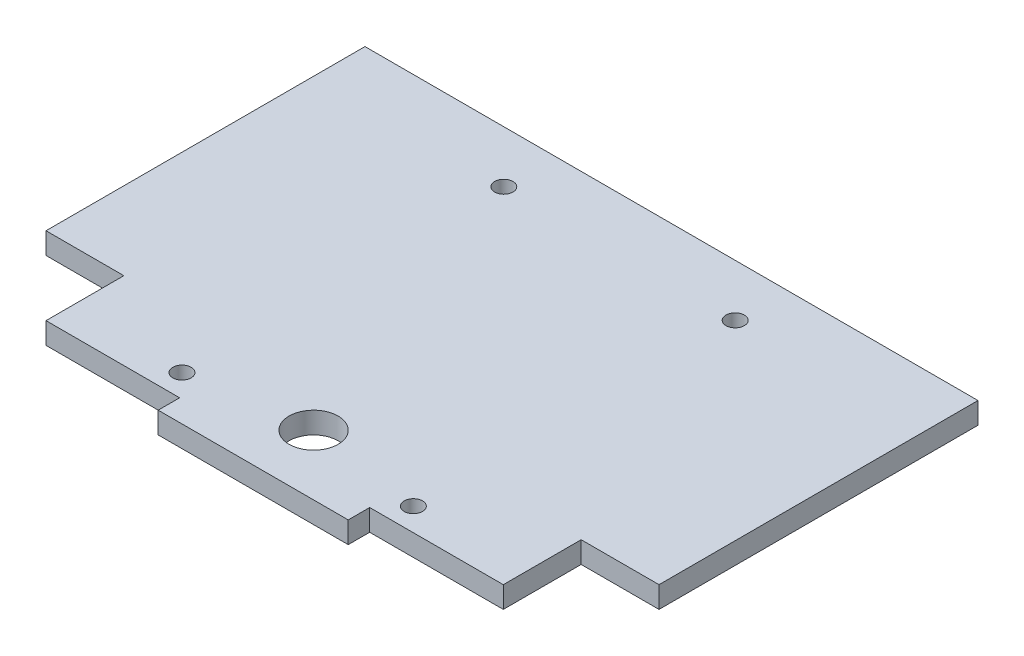
ISO-10303-21;
HEADER;
FILE_DESCRIPTION(('STEP AP214'),'2;1');
FILE_NAME('part.step','',(''),(''),'','','');
FILE_SCHEMA(('AUTOMOTIVE_DESIGN { 1 0 10303 214 1 1 1 1 }'));
ENDSEC;
DATA;
#1=APPLICATION_CONTEXT('core data for automotive mechanical design processes');
#2=APPLICATION_PROTOCOL_DEFINITION('international standard','automotive_design',2000,#1);
#3=PRODUCT_CONTEXT('',#1,'mechanical');
#4=PRODUCT('Part','Part','',(#3));
#5=PRODUCT_RELATED_PRODUCT_CATEGORY('part','',(#4));
#6=PRODUCT_DEFINITION_FORMATION('','',#4);
#7=PRODUCT_DEFINITION_CONTEXT('part definition',#1,'design');
#8=PRODUCT_DEFINITION('design','',#6,#7);
#9=PRODUCT_DEFINITION_SHAPE('','',#8);
#10=(LENGTH_UNIT() NAMED_UNIT(*) SI_UNIT(.MILLI.,.METRE.));
#11=(NAMED_UNIT(*) PLANE_ANGLE_UNIT() SI_UNIT($,.RADIAN.));
#12=(NAMED_UNIT(*) SI_UNIT($,.STERADIAN.) SOLID_ANGLE_UNIT());
#13=UNCERTAINTY_MEASURE_WITH_UNIT(LENGTH_MEASURE(1.E-05),#10,'distance_accuracy_value','');
#14=(GEOMETRIC_REPRESENTATION_CONTEXT(3) GLOBAL_UNCERTAINTY_ASSIGNED_CONTEXT((#13)) GLOBAL_UNIT_ASSIGNED_CONTEXT((#10,
#11,#12)) REPRESENTATION_CONTEXT('',''));
#15=CARTESIAN_POINT('',(0.,0.,0.));
#16=DIRECTION('',(0.,0.,1.));
#17=DIRECTION('',(1.,0.,0.));
#18=AXIS2_PLACEMENT_3D('',#15,#16,#17);
#19=CARTESIAN_POINT('',(0.,7.,-25.4));
#20=DIRECTION('',(0.,0.,-1.));
#21=DIRECTION('',(-1.,0.,0.));
#22=AXIS2_PLACEMENT_3D('',#19,#20,#21);
#23=PLANE('',#22);
#24=DIRECTION('',(1.,0.,0.));
#25=VECTOR('',#24,1.);
#26=CARTESIAN_POINT('',(0.,0.,-25.4));
#27=LINE('',#26,#25);
#28=CARTESIAN_POINT('',(-100.,0.,-25.4));
#29=VERTEX_POINT('',#28);
#30=CARTESIAN_POINT('',(-74.6,0.,-25.4));
#31=VERTEX_POINT('',#30);
#32=EDGE_CURVE('E141',#29,#31,#27,.T.);
#33=ORIENTED_EDGE('',*,*,#32,.T.);
#34=DIRECTION('',(0.,-1.,0.));
#35=VECTOR('',#34,1.);
#36=CARTESIAN_POINT('',(-74.6,7.,-25.4));
#37=LINE('',#36,#35);
#38=CARTESIAN_POINT('',(-74.6,7.,-25.4));
#39=VERTEX_POINT('',#38);
#40=EDGE_CURVE('E136',#39,#31,#37,.T.);
#41=ORIENTED_EDGE('',*,*,#40,.F.);
#42=DIRECTION('',(1.,0.,0.));
#43=VECTOR('',#42,1.);
#44=CARTESIAN_POINT('',(0.,7.,-25.4));
#45=LINE('',#44,#43);
#46=CARTESIAN_POINT('',(-100.,7.,-25.4));
#47=VERTEX_POINT('',#46);
#48=EDGE_CURVE('E220',#47,#39,#45,.T.);
#49=ORIENTED_EDGE('',*,*,#48,.F.);
#50=DIRECTION('',(0.,-1.,0.));
#51=VECTOR('',#50,1.);
#52=CARTESIAN_POINT('',(-100.,7.,-25.4));
#53=LINE('',#52,#51);
#54=EDGE_CURVE('E54',#47,#29,#53,.T.);
#55=ORIENTED_EDGE('',*,*,#54,.T.);
#56=EDGE_LOOP('',(#33,#41,#49,#55));
#57=FACE_BOUND('',#56,.T.);
#58=ADVANCED_FACE('F44',(#57),#23,.F.);
#59=CARTESIAN_POINT('',(-100.,7.,0.));
#60=DIRECTION('',(-1.,0.,0.));
#61=DIRECTION('',(0.,0.,1.));
#62=AXIS2_PLACEMENT_3D('',#59,#60,#61);
#63=PLANE('',#62);
#64=DIRECTION('',(0.,0.,-1.));
#65=VECTOR('',#64,1.);
#66=CARTESIAN_POINT('',(-100.,0.,0.));
#67=LINE('',#66,#65);
#68=CARTESIAN_POINT('',(-100.,0.,-129.468576745222));
#69=VERTEX_POINT('',#68);
#70=EDGE_CURVE('E87',#29,#69,#67,.T.);
#71=ORIENTED_EDGE('',*,*,#70,.F.);
#72=ORIENTED_EDGE('',*,*,#54,.F.);
#73=DIRECTION('',(0.,0.,-1.));
#74=VECTOR('',#73,1.);
#75=CARTESIAN_POINT('',(-100.,7.,0.));
#76=LINE('',#75,#74);
#77=CARTESIAN_POINT('',(-100.,7.,-129.468576745222));
#78=VERTEX_POINT('',#77);
#79=EDGE_CURVE('E79',#47,#78,#76,.T.);
#80=ORIENTED_EDGE('',*,*,#79,.T.);
#81=DIRECTION('',(0.,-1.,0.));
#82=VECTOR('',#81,1.);
#83=CARTESIAN_POINT('',(-100.,7.,-129.468576745222));
#84=LINE('',#83,#82);
#85=EDGE_CURVE('E48',#78,#69,#84,.T.);
#86=ORIENTED_EDGE('',*,*,#85,.T.);
#87=EDGE_LOOP('',(#71,#72,#80,#86));
#88=FACE_BOUND('',#87,.T.);
#89=ADVANCED_FACE('F356',(#88),#63,.T.);
#90=CARTESIAN_POINT('',(0.,7.,-12.7));
#91=DIRECTION('',(0.,-1.,0.));
#92=DIRECTION('',(0.,0.,-1.));
#93=AXIS2_PLACEMENT_3D('',#90,#91,#92);
#94=CYLINDRICAL_SURFACE('',#93,8.);
#95=CARTESIAN_POINT('',(0.,0.,-12.7));
#96=DIRECTION('',(0.,1.,0.));
#97=DIRECTION('',(0.,0.,1.));
#98=AXIS2_PLACEMENT_3D('',#95,#96,#97);
#99=CIRCLE('',#98,8.);
#100=CARTESIAN_POINT('',(0.,0.,-4.69999999999999));
#101=VERTEX_POINT('',#100);
#102=EDGE_CURVE('E230',#101,#101,#99,.F.);
#103=ORIENTED_EDGE('',*,*,#102,.T.);
#104=EDGE_LOOP('',(#103));
#105=FACE_BOUND('',#104,.T.);
#106=CARTESIAN_POINT('',(0.,7.,-12.7));
#107=DIRECTION('',(0.,1.,0.));
#108=DIRECTION('',(0.,0.,1.));
#109=AXIS2_PLACEMENT_3D('',#106,#107,#108);
#110=CIRCLE('',#109,8.);
#111=CARTESIAN_POINT('',(0.,7.,-4.69999999999999));
#112=VERTEX_POINT('',#111);
#113=EDGE_CURVE('E126',#112,#112,#110,.F.);
#114=ORIENTED_EDGE('',*,*,#113,.F.);
#115=EDGE_LOOP('',(#114));
#116=FACE_BOUND('',#115,.T.);
#117=ADVANCED_FACE('F354',(#105,#116),#94,.F.);
#118=CARTESIAN_POINT('',(0.,0.,0.));
#119=DIRECTION('',(0.,1.,0.));
#120=DIRECTION('',(0.,0.,1.));
#121=AXIS2_PLACEMENT_3D('',#118,#119,#120);
#122=PLANE('',#121);
#123=CARTESIAN_POINT('',(-37.75,0.,-7.5));
#124=DIRECTION('',(0.,1.,0.));
#125=DIRECTION('',(0.,0.,1.));
#126=AXIS2_PLACEMENT_3D('',#123,#124,#125);
#127=CIRCLE('',#126,3.);
#128=CARTESIAN_POINT('',(-37.75,0.,-4.5));
#129=VERTEX_POINT('',#128);
#130=EDGE_CURVE('E280',#129,#129,#127,.T.);
#131=ORIENTED_EDGE('',*,*,#130,.T.);
#132=EDGE_LOOP('',(#131));
#133=FACE_BOUND('',#132,.T.);
#134=CARTESIAN_POINT('',(37.75,0.,-7.50000000000001));
#135=DIRECTION('',(0.,1.,0.));
#136=DIRECTION('',(0.,0.,1.));
#137=AXIS2_PLACEMENT_3D('',#134,#135,#136);
#138=CIRCLE('',#137,3.);
#139=CARTESIAN_POINT('',(37.75,0.,-4.50000000000002));
#140=VERTEX_POINT('',#139);
#141=EDGE_CURVE('E271',#140,#140,#138,.T.);
#142=ORIENTED_EDGE('',*,*,#141,.T.);
#143=EDGE_LOOP('',(#142));
#144=FACE_BOUND('',#143,.T.);
#145=CARTESIAN_POINT('',(37.75,0.,-112.5));
#146=DIRECTION('',(0.,1.,0.));
#147=DIRECTION('',(0.,0.,1.));
#148=AXIS2_PLACEMENT_3D('',#145,#146,#147);
#149=CIRCLE('',#148,3.);
#150=CARTESIAN_POINT('',(37.75,0.,-109.5));
#151=VERTEX_POINT('',#150);
#152=EDGE_CURVE('E262',#151,#151,#149,.T.);
#153=ORIENTED_EDGE('',*,*,#152,.T.);
#154=EDGE_LOOP('',(#153));
#155=FACE_BOUND('',#154,.T.);
#156=CARTESIAN_POINT('',(-37.75,0.,-112.5));
#157=DIRECTION('',(0.,1.,0.));
#158=DIRECTION('',(0.,0.,1.));
#159=AXIS2_PLACEMENT_3D('',#156,#157,#158);
#160=CIRCLE('',#159,3.);
#161=CARTESIAN_POINT('',(-37.75,0.,-109.5));
#162=VERTEX_POINT('',#161);
#163=EDGE_CURVE('E256',#162,#162,#160,.T.);
#164=ORIENTED_EDGE('',*,*,#163,.T.);
#165=EDGE_LOOP('',(#164));
#166=FACE_BOUND('',#165,.T.);
#167=ORIENTED_EDGE('',*,*,#102,.F.);
#168=EDGE_LOOP('',(#167));
#169=FACE_BOUND('',#168,.T.);
#170=DIRECTION('',(0.,0.,1.));
#171=VECTOR('',#170,1.);
#172=CARTESIAN_POINT('',(31.,0.,0.));
#173=LINE('',#172,#171);
#174=CARTESIAN_POINT('',(31.,0.,0.));
#175=VERTEX_POINT('',#174);
#176=CARTESIAN_POINT('',(31.,0.,7.));
#177=VERTEX_POINT('',#176);
#178=EDGE_CURVE('E95',#175,#177,#173,.T.);
#179=ORIENTED_EDGE('',*,*,#178,.T.);
#180=DIRECTION('',(-1.,0.,0.));
#181=VECTOR('',#180,1.);
#182=CARTESIAN_POINT('',(0.,0.,7.));
#183=LINE('',#182,#181);
#184=CARTESIAN_POINT('',(-31.,0.,7.));
#185=VERTEX_POINT('',#184);
#186=EDGE_CURVE('E311',#177,#185,#183,.T.);
#187=ORIENTED_EDGE('',*,*,#186,.T.);
#188=DIRECTION('',(0.,0.,1.));
#189=VECTOR('',#188,1.);
#190=CARTESIAN_POINT('',(-31.,0.,0.));
#191=LINE('',#190,#189);
#192=CARTESIAN_POINT('',(-31.,0.,0.));
#193=VERTEX_POINT('',#192);
#194=EDGE_CURVE('E125',#193,#185,#191,.T.);
#195=ORIENTED_EDGE('',*,*,#194,.F.);
#196=DIRECTION('',(-1.,0.,0.));
#197=VECTOR('',#196,1.);
#198=CARTESIAN_POINT('',(0.,0.,0.));
#199=LINE('',#198,#197);
#200=CARTESIAN_POINT('',(-74.6,0.,0.));
#201=VERTEX_POINT('',#200);
#202=EDGE_CURVE('E118',#193,#201,#199,.T.);
#203=ORIENTED_EDGE('',*,*,#202,.T.);
#204=DIRECTION('',(0.,0.,-1.));
#205=VECTOR('',#204,1.);
#206=CARTESIAN_POINT('',(-74.6,0.,0.));
#207=LINE('',#206,#205);
#208=EDGE_CURVE('E122',#201,#31,#207,.T.);
#209=ORIENTED_EDGE('',*,*,#208,.T.);
#210=ORIENTED_EDGE('',*,*,#32,.F.);
#211=ORIENTED_EDGE('',*,*,#70,.T.);
#212=DIRECTION('',(1.,0.,0.));
#213=VECTOR('',#212,1.);
#214=CARTESIAN_POINT('',(-100.,0.,-129.468576745222));
#215=LINE('',#214,#213);
#216=CARTESIAN_POINT('',(100.,0.,-129.468576745222));
#217=VERTEX_POINT('',#216);
#218=EDGE_CURVE('E215',#69,#217,#215,.T.);
#219=ORIENTED_EDGE('',*,*,#218,.T.);
#220=DIRECTION('',(0.,0.,-1.));
#221=VECTOR('',#220,1.);
#222=CARTESIAN_POINT('',(100.,0.,0.));
#223=LINE('',#222,#221);
#224=CARTESIAN_POINT('',(100.,0.,-25.4));
#225=VERTEX_POINT('',#224);
#226=EDGE_CURVE('E180',#225,#217,#223,.T.);
#227=ORIENTED_EDGE('',*,*,#226,.F.);
#228=DIRECTION('',(-1.,0.,0.));
#229=VECTOR('',#228,1.);
#230=CARTESIAN_POINT('',(0.,0.,-25.4));
#231=LINE('',#230,#229);
#232=CARTESIAN_POINT('',(74.6,0.,-25.4));
#233=VERTEX_POINT('',#232);
#234=EDGE_CURVE('E202',#225,#233,#231,.T.);
#235=ORIENTED_EDGE('',*,*,#234,.T.);
#236=DIRECTION('',(0.,0.,-1.));
#237=VECTOR('',#236,1.);
#238=CARTESIAN_POINT('',(74.6,0.,0.));
#239=LINE('',#238,#237);
#240=CARTESIAN_POINT('',(74.6,0.,0.));
#241=VERTEX_POINT('',#240);
#242=EDGE_CURVE('E199',#241,#233,#239,.T.);
#243=ORIENTED_EDGE('',*,*,#242,.F.);
#244=DIRECTION('',(1.,0.,0.));
#245=VECTOR('',#244,1.);
#246=CARTESIAN_POINT('',(0.,0.,0.));
#247=LINE('',#246,#245);
#248=EDGE_CURVE('E174',#175,#241,#247,.T.);
#249=ORIENTED_EDGE('',*,*,#248,.F.);
#250=EDGE_LOOP('',(#179,#187,#195,#203,#209,#210,#211,#219,#227,#235,#243,#249));
#251=FACE_BOUND('',#250,.T.);
#252=ADVANCED_FACE('F120',(#133,#144,#155,#166,#169,#251),#122,.F.);
#253=CARTESIAN_POINT('',(-74.6,7.,0.));
#254=DIRECTION('',(-1.,0.,0.));
#255=DIRECTION('',(0.,0.,1.));
#256=AXIS2_PLACEMENT_3D('',#253,#254,#255);
#257=PLANE('',#256);
#258=ORIENTED_EDGE('',*,*,#208,.F.);
#259=DIRECTION('',(0.,-1.,0.));
#260=VECTOR('',#259,1.);
#261=CARTESIAN_POINT('',(-74.6,7.,0.));
#262=LINE('',#261,#260);
#263=CARTESIAN_POINT('',(-74.6,7.,0.));
#264=VERTEX_POINT('',#263);
#265=EDGE_CURVE('E129',#264,#201,#262,.T.);
#266=ORIENTED_EDGE('',*,*,#265,.F.);
#267=DIRECTION('',(0.,0.,-1.));
#268=VECTOR('',#267,1.);
#269=CARTESIAN_POINT('',(-74.6,7.,0.));
#270=LINE('',#269,#268);
#271=EDGE_CURVE('E226',#264,#39,#270,.T.);
#272=ORIENTED_EDGE('',*,*,#271,.T.);
#273=ORIENTED_EDGE('',*,*,#40,.T.);
#274=EDGE_LOOP('',(#258,#266,#272,#273));
#275=FACE_BOUND('',#274,.T.);
#276=ADVANCED_FACE('F138',(#275),#257,.T.);
#277=CARTESIAN_POINT('',(0.,7.,0.));
#278=DIRECTION('',(0.,1.,0.));
#279=DIRECTION('',(0.,0.,1.));
#280=AXIS2_PLACEMENT_3D('',#277,#278,#279);
#281=PLANE('',#280);
#282=CARTESIAN_POINT('',(-37.75,7.,-7.5));
#283=DIRECTION('',(0.,1.,0.));
#284=DIRECTION('',(0.,0.,1.));
#285=AXIS2_PLACEMENT_3D('',#282,#283,#284);
#286=CIRCLE('',#285,2.99999999999999);
#287=CARTESIAN_POINT('',(-37.75,7.,-4.50000000000001));
#288=VERTEX_POINT('',#287);
#289=EDGE_CURVE('E282',#288,#288,#286,.T.);
#290=ORIENTED_EDGE('',*,*,#289,.F.);
#291=EDGE_LOOP('',(#290));
#292=FACE_BOUND('',#291,.T.);
#293=CARTESIAN_POINT('',(37.75,7.,-7.50000000000001));
#294=DIRECTION('',(0.,1.,0.));
#295=DIRECTION('',(0.,0.,1.));
#296=AXIS2_PLACEMENT_3D('',#293,#294,#295);
#297=CIRCLE('',#296,2.99999999999999);
#298=CARTESIAN_POINT('',(37.75,7.,-4.50000000000002));
#299=VERTEX_POINT('',#298);
#300=EDGE_CURVE('E276',#299,#299,#297,.T.);
#301=ORIENTED_EDGE('',*,*,#300,.F.);
#302=EDGE_LOOP('',(#301));
#303=FACE_BOUND('',#302,.T.);
#304=CARTESIAN_POINT('',(37.75,7.,-112.5));
#305=DIRECTION('',(0.,1.,0.));
#306=DIRECTION('',(0.,0.,1.));
#307=AXIS2_PLACEMENT_3D('',#304,#305,#306);
#308=CIRCLE('',#307,2.99999999999999);
#309=CARTESIAN_POINT('',(37.75,7.,-109.5));
#310=VERTEX_POINT('',#309);
#311=EDGE_CURVE('E267',#310,#310,#308,.T.);
#312=ORIENTED_EDGE('',*,*,#311,.F.);
#313=EDGE_LOOP('',(#312));
#314=FACE_BOUND('',#313,.T.);
#315=CARTESIAN_POINT('',(-37.75,7.,-112.5));
#316=DIRECTION('',(0.,1.,0.));
#317=DIRECTION('',(0.,0.,1.));
#318=AXIS2_PLACEMENT_3D('',#315,#316,#317);
#319=CIRCLE('',#318,2.99999999999999);
#320=CARTESIAN_POINT('',(-37.75,7.,-109.5));
#321=VERTEX_POINT('',#320);
#322=EDGE_CURVE('E258',#321,#321,#319,.T.);
#323=ORIENTED_EDGE('',*,*,#322,.F.);
#324=EDGE_LOOP('',(#323));
#325=FACE_BOUND('',#324,.T.);
#326=ORIENTED_EDGE('',*,*,#113,.T.);
#327=EDGE_LOOP('',(#326));
#328=FACE_BOUND('',#327,.T.);
#329=DIRECTION('',(-1.,0.,0.));
#330=VECTOR('',#329,1.);
#331=CARTESIAN_POINT('',(0.,7.,7.));
#332=LINE('',#331,#330);
#333=CARTESIAN_POINT('',(31.,7.,7.));
#334=VERTEX_POINT('',#333);
#335=CARTESIAN_POINT('',(-31.,7.,7.));
#336=VERTEX_POINT('',#335);
#337=EDGE_CURVE('E148',#334,#336,#332,.T.);
#338=ORIENTED_EDGE('',*,*,#337,.F.);
#339=DIRECTION('',(0.,0.,1.));
#340=VECTOR('',#339,1.);
#341=CARTESIAN_POINT('',(31.,7.,0.));
#342=LINE('',#341,#340);
#343=CARTESIAN_POINT('',(31.,7.,0.));
#344=VERTEX_POINT('',#343);
#345=EDGE_CURVE('E163',#344,#334,#342,.T.);
#346=ORIENTED_EDGE('',*,*,#345,.F.);
#347=DIRECTION('',(1.,0.,0.));
#348=VECTOR('',#347,1.);
#349=CARTESIAN_POINT('',(0.,7.,0.));
#350=LINE('',#349,#348);
#351=CARTESIAN_POINT('',(74.6,7.,0.));
#352=VERTEX_POINT('',#351);
#353=EDGE_CURVE('E175',#344,#352,#350,.T.);
#354=ORIENTED_EDGE('',*,*,#353,.T.);
#355=DIRECTION('',(0.,0.,-1.));
#356=VECTOR('',#355,1.);
#357=CARTESIAN_POINT('',(74.6,7.,0.));
#358=LINE('',#357,#356);
#359=CARTESIAN_POINT('',(74.6,7.,-25.4));
#360=VERTEX_POINT('',#359);
#361=EDGE_CURVE('E179',#352,#360,#358,.T.);
#362=ORIENTED_EDGE('',*,*,#361,.T.);
#363=DIRECTION('',(-1.,0.,0.));
#364=VECTOR('',#363,1.);
#365=CARTESIAN_POINT('',(0.,7.,-25.4));
#366=LINE('',#365,#364);
#367=CARTESIAN_POINT('',(100.,7.,-25.4));
#368=VERTEX_POINT('',#367);
#369=EDGE_CURVE('E184',#368,#360,#366,.T.);
#370=ORIENTED_EDGE('',*,*,#369,.F.);
#371=DIRECTION('',(0.,0.,-1.));
#372=VECTOR('',#371,1.);
#373=CARTESIAN_POINT('',(100.,7.,0.));
#374=LINE('',#373,#372);
#375=CARTESIAN_POINT('',(100.,7.,-129.468576745222));
#376=VERTEX_POINT('',#375);
#377=EDGE_CURVE('E192',#368,#376,#374,.T.);
#378=ORIENTED_EDGE('',*,*,#377,.T.);
#379=DIRECTION('',(1.,0.,0.));
#380=VECTOR('',#379,1.);
#381=CARTESIAN_POINT('',(-100.,7.,-129.468576745222));
#382=LINE('',#381,#380);
#383=EDGE_CURVE('E240',#78,#376,#382,.T.);
#384=ORIENTED_EDGE('',*,*,#383,.F.);
#385=ORIENTED_EDGE('',*,*,#79,.F.);
#386=ORIENTED_EDGE('',*,*,#48,.T.);
#387=ORIENTED_EDGE('',*,*,#271,.F.);
#388=DIRECTION('',(-1.,0.,0.));
#389=VECTOR('',#388,1.);
#390=CARTESIAN_POINT('',(0.,7.,0.));
#391=LINE('',#390,#389);
#392=CARTESIAN_POINT('',(-31.,7.,0.));
#393=VERTEX_POINT('',#392);
#394=EDGE_CURVE('E132',#393,#264,#391,.T.);
#395=ORIENTED_EDGE('',*,*,#394,.F.);
#396=DIRECTION('',(0.,0.,1.));
#397=VECTOR('',#396,1.);
#398=CARTESIAN_POINT('',(-31.,7.,0.));
#399=LINE('',#398,#397);
#400=EDGE_CURVE('E151',#393,#336,#399,.T.);
#401=ORIENTED_EDGE('',*,*,#400,.T.);
#402=EDGE_LOOP('',(#338,#346,#354,#362,#370,#378,#384,#385,#386,#387,#395,#401));
#403=FACE_BOUND('',#402,.T.);
#404=ADVANCED_FACE('F289',(#292,#303,#314,#325,#328,#403),#281,.T.);
#405=CARTESIAN_POINT('',(0.,7.,0.));
#406=DIRECTION('',(0.,0.,1.));
#407=DIRECTION('',(1.,0.,0.));
#408=AXIS2_PLACEMENT_3D('',#405,#406,#407);
#409=PLANE('',#408);
#410=DIRECTION('',(0.,-1.,0.));
#411=VECTOR('',#410,1.);
#412=CARTESIAN_POINT('',(-31.,7.,0.));
#413=LINE('',#412,#411);
#414=EDGE_CURVE('E12',#393,#193,#413,.T.);
#415=ORIENTED_EDGE('',*,*,#414,.F.);
#416=ORIENTED_EDGE('',*,*,#394,.T.);
#417=ORIENTED_EDGE('',*,*,#265,.T.);
#418=ORIENTED_EDGE('',*,*,#202,.F.);
#419=EDGE_LOOP('',(#415,#416,#417,#418));
#420=FACE_BOUND('',#419,.T.);
#421=ADVANCED_FACE('F130',(#420),#409,.T.);
#422=CARTESIAN_POINT('',(0.,7.,7.));
#423=DIRECTION('',(0.,0.,1.));
#424=DIRECTION('',(1.,0.,0.));
#425=AXIS2_PLACEMENT_3D('',#422,#423,#424);
#426=PLANE('',#425);
#427=ORIENTED_EDGE('',*,*,#186,.F.);
#428=DIRECTION('',(0.,-1.,0.));
#429=VECTOR('',#428,1.);
#430=CARTESIAN_POINT('',(31.,7.,7.));
#431=LINE('',#430,#429);
#432=EDGE_CURVE('E172',#334,#177,#431,.T.);
#433=ORIENTED_EDGE('',*,*,#432,.F.);
#434=ORIENTED_EDGE('',*,*,#337,.T.);
#435=DIRECTION('',(0.,-1.,0.));
#436=VECTOR('',#435,1.);
#437=CARTESIAN_POINT('',(-31.,7.,7.));
#438=LINE('',#437,#436);
#439=EDGE_CURVE('E232',#336,#185,#438,.T.);
#440=ORIENTED_EDGE('',*,*,#439,.T.);
#441=EDGE_LOOP('',(#427,#433,#434,#440));
#442=FACE_BOUND('',#441,.T.);
#443=ADVANCED_FACE('F309',(#442),#426,.T.);
#444=CARTESIAN_POINT('',(-31.,7.,0.));
#445=DIRECTION('',(1.,0.,0.));
#446=DIRECTION('',(0.,0.,-1.));
#447=AXIS2_PLACEMENT_3D('',#444,#445,#446);
#448=PLANE('',#447);
#449=ORIENTED_EDGE('',*,*,#194,.T.);
#450=ORIENTED_EDGE('',*,*,#439,.F.);
#451=ORIENTED_EDGE('',*,*,#400,.F.);
#452=ORIENTED_EDGE('',*,*,#414,.T.);
#453=EDGE_LOOP('',(#449,#450,#451,#452));
#454=FACE_BOUND('',#453,.T.);
#455=ADVANCED_FACE('F343',(#454),#448,.F.);
#456=CARTESIAN_POINT('',(-100.,7.,-129.468576745222));
#457=DIRECTION('',(0.,0.,-1.));
#458=DIRECTION('',(-1.,0.,0.));
#459=AXIS2_PLACEMENT_3D('',#456,#457,#458);
#460=PLANE('',#459);
#461=ORIENTED_EDGE('',*,*,#218,.F.);
#462=ORIENTED_EDGE('',*,*,#85,.F.);
#463=ORIENTED_EDGE('',*,*,#383,.T.);
#464=DIRECTION('',(0.,-1.,0.));
#465=VECTOR('',#464,1.);
#466=CARTESIAN_POINT('',(100.,7.,-129.468576745222));
#467=LINE('',#466,#465);
#468=EDGE_CURVE('E169',#376,#217,#467,.T.);
#469=ORIENTED_EDGE('',*,*,#468,.T.);
#470=EDGE_LOOP('',(#461,#462,#463,#469));
#471=FACE_BOUND('',#470,.T.);
#472=ADVANCED_FACE('F46',(#471),#460,.T.);
#473=CARTESIAN_POINT('',(0.,7.,0.));
#474=DIRECTION('',(0.,0.,-1.));
#475=DIRECTION('',(-1.,0.,0.));
#476=AXIS2_PLACEMENT_3D('',#473,#474,#475);
#477=PLANE('',#476);
#478=ORIENTED_EDGE('',*,*,#353,.F.);
#479=DIRECTION('',(0.,-1.,0.));
#480=VECTOR('',#479,1.);
#481=CARTESIAN_POINT('',(31.,7.,0.));
#482=LINE('',#481,#480);
#483=EDGE_CURVE('E168',#344,#175,#482,.T.);
#484=ORIENTED_EDGE('',*,*,#483,.T.);
#485=ORIENTED_EDGE('',*,*,#248,.T.);
#486=DIRECTION('',(0.,-1.,0.));
#487=VECTOR('',#486,1.);
#488=CARTESIAN_POINT('',(74.6,7.,0.));
#489=LINE('',#488,#487);
#490=EDGE_CURVE('E212',#352,#241,#489,.T.);
#491=ORIENTED_EDGE('',*,*,#490,.F.);
#492=EDGE_LOOP('',(#478,#484,#485,#491));
#493=FACE_BOUND('',#492,.T.);
#494=ADVANCED_FACE('F316',(#493),#477,.F.);
#495=CARTESIAN_POINT('',(74.6,7.,0.));
#496=DIRECTION('',(-1.,0.,0.));
#497=DIRECTION('',(0.,0.,1.));
#498=AXIS2_PLACEMENT_3D('',#495,#496,#497);
#499=PLANE('',#498);
#500=ORIENTED_EDGE('',*,*,#242,.T.);
#501=DIRECTION('',(0.,-1.,0.));
#502=VECTOR('',#501,1.);
#503=CARTESIAN_POINT('',(74.6,7.,-25.4));
#504=LINE('',#503,#502);
#505=EDGE_CURVE('E209',#360,#233,#504,.T.);
#506=ORIENTED_EDGE('',*,*,#505,.F.);
#507=ORIENTED_EDGE('',*,*,#361,.F.);
#508=ORIENTED_EDGE('',*,*,#490,.T.);
#509=EDGE_LOOP('',(#500,#506,#507,#508));
#510=FACE_BOUND('',#509,.T.);
#511=ADVANCED_FACE('F323',(#510),#499,.F.);
#512=CARTESIAN_POINT('',(0.,7.,-25.4));
#513=DIRECTION('',(0.,0.,1.));
#514=DIRECTION('',(1.,0.,0.));
#515=AXIS2_PLACEMENT_3D('',#512,#513,#514);
#516=PLANE('',#515);
#517=ORIENTED_EDGE('',*,*,#234,.F.);
#518=DIRECTION('',(0.,-1.,0.));
#519=VECTOR('',#518,1.);
#520=CARTESIAN_POINT('',(100.,7.,-25.4));
#521=LINE('',#520,#519);
#522=EDGE_CURVE('E196',#368,#225,#521,.T.);
#523=ORIENTED_EDGE('',*,*,#522,.F.);
#524=ORIENTED_EDGE('',*,*,#369,.T.);
#525=ORIENTED_EDGE('',*,*,#505,.T.);
#526=EDGE_LOOP('',(#517,#523,#524,#525));
#527=FACE_BOUND('',#526,.T.);
#528=ADVANCED_FACE('F333',(#527),#516,.T.);
#529=CARTESIAN_POINT('',(100.,7.,0.));
#530=DIRECTION('',(-1.,0.,0.));
#531=DIRECTION('',(0.,0.,1.));
#532=AXIS2_PLACEMENT_3D('',#529,#530,#531);
#533=PLANE('',#532);
#534=ORIENTED_EDGE('',*,*,#226,.T.);
#535=ORIENTED_EDGE('',*,*,#468,.F.);
#536=ORIENTED_EDGE('',*,*,#377,.F.);
#537=ORIENTED_EDGE('',*,*,#522,.T.);
#538=EDGE_LOOP('',(#534,#535,#536,#537));
#539=FACE_BOUND('',#538,.T.);
#540=ADVANCED_FACE('F253',(#539),#533,.F.);
#541=CARTESIAN_POINT('',(31.,7.,0.));
#542=DIRECTION('',(1.,0.,0.));
#543=DIRECTION('',(0.,0.,-1.));
#544=AXIS2_PLACEMENT_3D('',#541,#542,#543);
#545=PLANE('',#544);
#546=ORIENTED_EDGE('',*,*,#178,.F.);
#547=ORIENTED_EDGE('',*,*,#483,.F.);
#548=ORIENTED_EDGE('',*,*,#345,.T.);
#549=ORIENTED_EDGE('',*,*,#432,.T.);
#550=EDGE_LOOP('',(#546,#547,#548,#549));
#551=FACE_BOUND('',#550,.T.);
#552=ADVANCED_FACE('F312',(#551),#545,.T.);
#553=CARTESIAN_POINT('',(-37.75,7.,-112.5));
#554=DIRECTION('',(0.,1.,0.));
#555=DIRECTION('',(0.,0.,1.));
#556=AXIS2_PLACEMENT_3D('',#553,#554,#555);
#557=CYLINDRICAL_SURFACE('',#556,2.99999999999999);
#558=ORIENTED_EDGE('',*,*,#163,.F.);
#559=EDGE_LOOP('',(#558));
#560=FACE_BOUND('',#559,.T.);
#561=ORIENTED_EDGE('',*,*,#322,.T.);
#562=EDGE_LOOP('',(#561));
#563=FACE_BOUND('',#562,.T.);
#564=ADVANCED_FACE('F406',(#560,#563),#557,.F.);
#565=CARTESIAN_POINT('',(37.75,7.,-112.5));
#566=DIRECTION('',(0.,1.,0.));
#567=DIRECTION('',(0.,0.,1.));
#568=AXIS2_PLACEMENT_3D('',#565,#566,#567);
#569=CYLINDRICAL_SURFACE('',#568,2.99999999999999);
#570=ORIENTED_EDGE('',*,*,#152,.F.);
#571=EDGE_LOOP('',(#570));
#572=FACE_BOUND('',#571,.T.);
#573=ORIENTED_EDGE('',*,*,#311,.T.);
#574=EDGE_LOOP('',(#573));
#575=FACE_BOUND('',#574,.T.);
#576=ADVANCED_FACE('F413',(#572,#575),#569,.F.);
#577=CARTESIAN_POINT('',(37.75,7.,-7.50000000000001));
#578=DIRECTION('',(0.,1.,0.));
#579=DIRECTION('',(0.,0.,1.));
#580=AXIS2_PLACEMENT_3D('',#577,#578,#579);
#581=CYLINDRICAL_SURFACE('',#580,2.99999999999999);
#582=ORIENTED_EDGE('',*,*,#141,.F.);
#583=EDGE_LOOP('',(#582));
#584=FACE_BOUND('',#583,.T.);
#585=ORIENTED_EDGE('',*,*,#300,.T.);
#586=EDGE_LOOP('',(#585));
#587=FACE_BOUND('',#586,.T.);
#588=ADVANCED_FACE('F421',(#584,#587),#581,.F.);
#589=CARTESIAN_POINT('',(-37.75,7.,-7.5));
#590=DIRECTION('',(0.,1.,0.));
#591=DIRECTION('',(0.,0.,1.));
#592=AXIS2_PLACEMENT_3D('',#589,#590,#591);
#593=CYLINDRICAL_SURFACE('',#592,2.99999999999999);
#594=ORIENTED_EDGE('',*,*,#130,.F.);
#595=EDGE_LOOP('',(#594));
#596=FACE_BOUND('',#595,.T.);
#597=ORIENTED_EDGE('',*,*,#289,.T.);
#598=EDGE_LOOP('',(#597));
#599=FACE_BOUND('',#598,.T.);
#600=ADVANCED_FACE('F287',(#596,#599),#593,.F.);
#601=CLOSED_SHELL('',(#58,#89,#117,#252,#276,#404,#421,#443,#455,#472,#494,#511,#528,#540,#552,
#564,#576,#588,#600));
#602=MANIFOLD_SOLID_BREP('B2',#601);
#603=ADVANCED_BREP_SHAPE_REPRESENTATION('',(#18,#602),#14);
#604=SHAPE_DEFINITION_REPRESENTATION(#9,#603);
ENDSEC;
END-ISO-10303-21;
